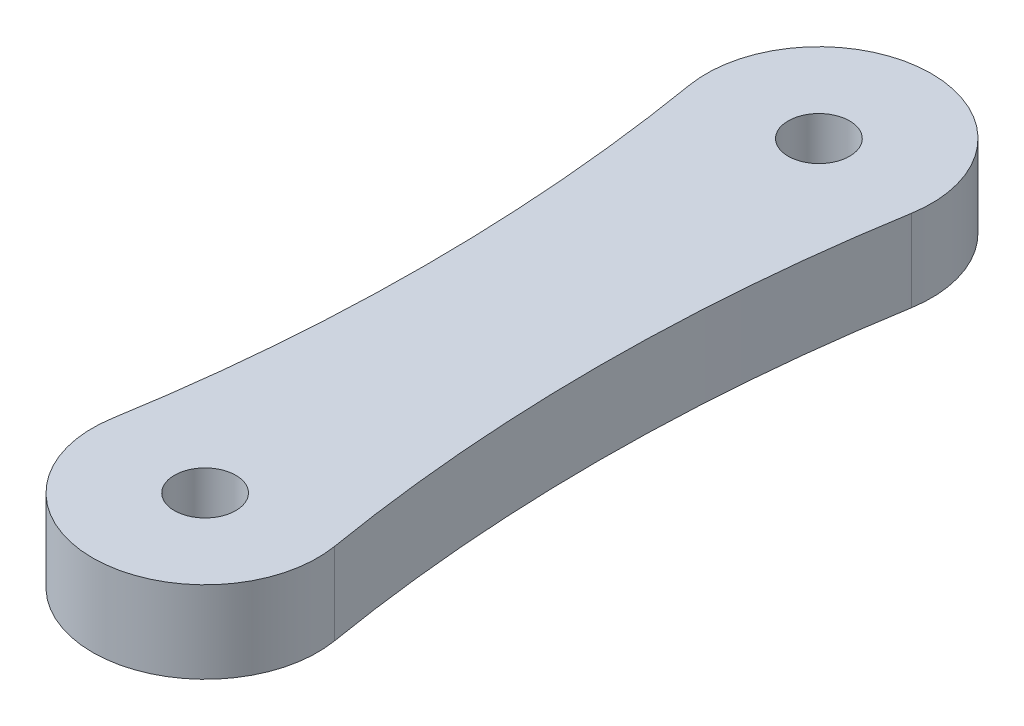
ISO-10303-21;
HEADER;
FILE_DESCRIPTION(('STEP AP214'),'2;1');
FILE_NAME('part.step','',(''),(''),'','','');
FILE_SCHEMA(('AUTOMOTIVE_DESIGN { 1 0 10303 214 1 1 1 1 }'));
ENDSEC;
DATA;
#1=APPLICATION_CONTEXT('core data for automotive mechanical design processes');
#2=APPLICATION_PROTOCOL_DEFINITION('international standard','automotive_design',2000,#1);
#3=PRODUCT_CONTEXT('',#1,'mechanical');
#4=PRODUCT('Part','Part','',(#3));
#5=PRODUCT_RELATED_PRODUCT_CATEGORY('part','',(#4));
#6=PRODUCT_DEFINITION_FORMATION('','',#4);
#7=PRODUCT_DEFINITION_CONTEXT('part definition',#1,'design');
#8=PRODUCT_DEFINITION('design','',#6,#7);
#9=PRODUCT_DEFINITION_SHAPE('','',#8);
#10=(LENGTH_UNIT() NAMED_UNIT(*) SI_UNIT(.MILLI.,.METRE.));
#11=(NAMED_UNIT(*) PLANE_ANGLE_UNIT() SI_UNIT($,.RADIAN.));
#12=(NAMED_UNIT(*) SI_UNIT($,.STERADIAN.) SOLID_ANGLE_UNIT());
#13=UNCERTAINTY_MEASURE_WITH_UNIT(LENGTH_MEASURE(1.E-05),#10,'distance_accuracy_value','');
#14=(GEOMETRIC_REPRESENTATION_CONTEXT(3) GLOBAL_UNCERTAINTY_ASSIGNED_CONTEXT((#13)) GLOBAL_UNIT_ASSIGNED_CONTEXT((#10,
#11,#12)) REPRESENTATION_CONTEXT('',''));
#15=CARTESIAN_POINT('',(0.,0.,0.));
#16=DIRECTION('',(0.,0.,1.));
#17=DIRECTION('',(1.,0.,0.));
#18=AXIS2_PLACEMENT_3D('',#15,#16,#17);
#19=CARTESIAN_POINT('',(-44.6875,4.,-7.49999999999998));
#20=DIRECTION('',(0.,-1.,0.));
#21=DIRECTION('',(0.,0.,-1.));
#22=AXIS2_PLACEMENT_3D('',#19,#20,#21);
#23=PLANE('',#22);
#24=CARTESIAN_POINT('',(-89.375,4.,-15.));
#25=DIRECTION('',(0.,-1.,0.));
#26=DIRECTION('',(0.,0.,-1.));
#27=AXIS2_PLACEMENT_3D('',#24,#25,#26);
#28=CIRCLE('',#27,85.125);
#29=CARTESIAN_POINT('',(-5.42413793103448,4.,-29.0896551724138));
#30=VERTEX_POINT('',#29);
#31=CARTESIAN_POINT('',(-5.42413793103449,4.,-0.910344827586199));
#32=VERTEX_POINT('',#31);
#33=EDGE_CURVE('E85',#30,#32,#28,.T.);
#34=ORIENTED_EDGE('',*,*,#33,.T.);
#35=CARTESIAN_POINT('',(0.,4.,0.));
#36=DIRECTION('',(0.,1.,0.));
#37=DIRECTION('',(0.,0.,1.));
#38=AXIS2_PLACEMENT_3D('',#35,#36,#37);
#39=CIRCLE('',#38,5.5);
#40=CARTESIAN_POINT('',(5.42413793103449,4.,-0.910344827586195));
#41=VERTEX_POINT('',#40);
#42=EDGE_CURVE('E80',#32,#41,#39,.T.);
#43=ORIENTED_EDGE('',*,*,#42,.T.);
#44=CARTESIAN_POINT('',(89.375,4.,-15.));
#45=DIRECTION('',(0.,-1.,0.));
#46=DIRECTION('',(0.,0.,1.));
#47=AXIS2_PLACEMENT_3D('',#44,#45,#46);
#48=CIRCLE('',#47,85.125);
#49=CARTESIAN_POINT('',(5.42413793103447,4.,-29.0896551724138));
#50=VERTEX_POINT('',#49);
#51=EDGE_CURVE('E83',#41,#50,#48,.T.);
#52=ORIENTED_EDGE('',*,*,#51,.T.);
#53=CARTESIAN_POINT('',(0.,4.,-30.));
#54=DIRECTION('',(0.,1.,0.));
#55=DIRECTION('',(0.,0.,1.));
#56=AXIS2_PLACEMENT_3D('',#53,#54,#55);
#57=CIRCLE('',#56,5.49999999999999);
#58=EDGE_CURVE('E50',#50,#30,#57,.T.);
#59=ORIENTED_EDGE('',*,*,#58,.T.);
#60=EDGE_LOOP('',(#34,#43,#52,#59));
#61=FACE_BOUND('',#60,.T.);
#62=CARTESIAN_POINT('',(0.,4.,0.));
#63=DIRECTION('',(0.,1.,0.));
#64=DIRECTION('',(0.,0.,1.));
#65=AXIS2_PLACEMENT_3D('',#62,#63,#64);
#66=CIRCLE('',#65,1.5);
#67=CARTESIAN_POINT('',(0.,4.,1.5));
#68=VERTEX_POINT('',#67);
#69=EDGE_CURVE('E100',#68,#68,#66,.T.);
#70=ORIENTED_EDGE('',*,*,#69,.F.);
#71=EDGE_LOOP('',(#70));
#72=FACE_BOUND('',#71,.T.);
#73=CARTESIAN_POINT('',(0.,4.,-30.));
#74=DIRECTION('',(0.,1.,0.));
#75=DIRECTION('',(0.,0.,1.));
#76=AXIS2_PLACEMENT_3D('',#73,#74,#75);
#77=CIRCLE('',#76,1.5);
#78=CARTESIAN_POINT('',(0.,4.,-28.5));
#79=VERTEX_POINT('',#78);
#80=EDGE_CURVE('E115',#79,#79,#77,.T.);
#81=ORIENTED_EDGE('',*,*,#80,.F.);
#82=EDGE_LOOP('',(#81));
#83=FACE_BOUND('',#82,.T.);
#84=ADVANCED_FACE('F33',(#61,#72,#83),#23,.F.);
#85=CARTESIAN_POINT('',(-44.6875,0.,-7.49999999999998));
#86=DIRECTION('',(0.,-1.,0.));
#87=DIRECTION('',(0.,0.,-1.));
#88=AXIS2_PLACEMENT_3D('',#85,#86,#87);
#89=PLANE('',#88);
#90=CARTESIAN_POINT('',(0.,0.,0.));
#91=DIRECTION('',(0.,1.,0.));
#92=DIRECTION('',(0.,0.,1.));
#93=AXIS2_PLACEMENT_3D('',#90,#91,#92);
#94=CIRCLE('',#93,1.5);
#95=CARTESIAN_POINT('',(0.,0.,1.5));
#96=VERTEX_POINT('',#95);
#97=EDGE_CURVE('E112',#96,#96,#94,.T.);
#98=ORIENTED_EDGE('',*,*,#97,.T.);
#99=EDGE_LOOP('',(#98));
#100=FACE_BOUND('',#99,.T.);
#101=CARTESIAN_POINT('',(-89.375,0.,-15.));
#102=DIRECTION('',(0.,-1.,0.));
#103=DIRECTION('',(0.,0.,-1.));
#104=AXIS2_PLACEMENT_3D('',#101,#102,#103);
#105=CIRCLE('',#104,85.125);
#106=CARTESIAN_POINT('',(-5.42413793103448,0.,-29.0896551724138));
#107=VERTEX_POINT('',#106);
#108=CARTESIAN_POINT('',(-5.42413793103449,0.,-0.910344827586199));
#109=VERTEX_POINT('',#108);
#110=EDGE_CURVE('E97',#107,#109,#105,.T.);
#111=ORIENTED_EDGE('',*,*,#110,.F.);
#112=CARTESIAN_POINT('',(0.,0.,-30.));
#113=DIRECTION('',(0.,1.,0.));
#114=DIRECTION('',(0.,0.,1.));
#115=AXIS2_PLACEMENT_3D('',#112,#113,#114);
#116=CIRCLE('',#115,5.49999999999999);
#117=CARTESIAN_POINT('',(5.42413793103447,0.,-29.0896551724138));
#118=VERTEX_POINT('',#117);
#119=EDGE_CURVE('E73',#118,#107,#116,.T.);
#120=ORIENTED_EDGE('',*,*,#119,.F.);
#121=CARTESIAN_POINT('',(89.375,0.,-15.));
#122=DIRECTION('',(0.,-1.,0.));
#123=DIRECTION('',(0.,0.,1.));
#124=AXIS2_PLACEMENT_3D('',#121,#122,#123);
#125=CIRCLE('',#124,85.125);
#126=CARTESIAN_POINT('',(5.42413793103449,0.,-0.910344827586195));
#127=VERTEX_POINT('',#126);
#128=EDGE_CURVE('E67',#127,#118,#125,.T.);
#129=ORIENTED_EDGE('',*,*,#128,.F.);
#130=CARTESIAN_POINT('',(0.,0.,0.));
#131=DIRECTION('',(0.,1.,0.));
#132=DIRECTION('',(0.,0.,1.));
#133=AXIS2_PLACEMENT_3D('',#130,#131,#132);
#134=CIRCLE('',#133,5.5);
#135=EDGE_CURVE('E89',#109,#127,#134,.T.);
#136=ORIENTED_EDGE('',*,*,#135,.F.);
#137=EDGE_LOOP('',(#111,#120,#129,#136));
#138=FACE_BOUND('',#137,.T.);
#139=CARTESIAN_POINT('',(0.,0.,-30.));
#140=DIRECTION('',(0.,1.,0.));
#141=DIRECTION('',(0.,0.,1.));
#142=AXIS2_PLACEMENT_3D('',#139,#140,#141);
#143=CIRCLE('',#142,1.5);
#144=CARTESIAN_POINT('',(0.,0.,-28.5));
#145=VERTEX_POINT('',#144);
#146=EDGE_CURVE('E118',#145,#145,#143,.T.);
#147=ORIENTED_EDGE('',*,*,#146,.T.);
#148=EDGE_LOOP('',(#147));
#149=FACE_BOUND('',#148,.T.);
#150=ADVANCED_FACE('F108',(#100,#138,#149),#89,.T.);
#151=CARTESIAN_POINT('',(-89.375,4.,-15.));
#152=DIRECTION('',(0.,-1.,0.));
#153=DIRECTION('',(0.,0.,-1.));
#154=AXIS2_PLACEMENT_3D('',#151,#152,#153);
#155=CYLINDRICAL_SURFACE('',#154,85.125);
#156=ORIENTED_EDGE('',*,*,#110,.T.);
#157=DIRECTION('',(0.,-1.,0.));
#158=VECTOR('',#157,1.);
#159=CARTESIAN_POINT('',(-5.42413793103449,4.,-0.910344827586199));
#160=LINE('',#159,#158);
#161=EDGE_CURVE('E11',#32,#109,#160,.T.);
#162=ORIENTED_EDGE('',*,*,#161,.F.);
#163=ORIENTED_EDGE('',*,*,#33,.F.);
#164=DIRECTION('',(0.,-1.,0.));
#165=VECTOR('',#164,1.);
#166=CARTESIAN_POINT('',(-5.42413793103448,4.,-29.0896551724138));
#167=LINE('',#166,#165);
#168=EDGE_CURVE('E93',#30,#107,#167,.T.);
#169=ORIENTED_EDGE('',*,*,#168,.T.);
#170=EDGE_LOOP('',(#156,#162,#163,#169));
#171=FACE_BOUND('',#170,.T.);
#172=ADVANCED_FACE('F35',(#171),#155,.F.);
#173=CARTESIAN_POINT('',(0.,4.,0.));
#174=DIRECTION('',(0.,-1.,0.));
#175=DIRECTION('',(0.,0.,-1.));
#176=AXIS2_PLACEMENT_3D('',#173,#174,#175);
#177=CYLINDRICAL_SURFACE('',#176,5.5);
#178=ORIENTED_EDGE('',*,*,#135,.T.);
#179=DIRECTION('',(0.,-1.,0.));
#180=VECTOR('',#179,1.);
#181=CARTESIAN_POINT('',(5.42413793103449,4.,-0.910344827586195));
#182=LINE('',#181,#180);
#183=EDGE_CURVE('E42',#41,#127,#182,.T.);
#184=ORIENTED_EDGE('',*,*,#183,.F.);
#185=ORIENTED_EDGE('',*,*,#42,.F.);
#186=ORIENTED_EDGE('',*,*,#161,.T.);
#187=EDGE_LOOP('',(#178,#184,#185,#186));
#188=FACE_BOUND('',#187,.T.);
#189=ADVANCED_FACE('F88',(#188),#177,.T.);
#190=CARTESIAN_POINT('',(89.375,4.,-15.));
#191=DIRECTION('',(0.,-1.,0.));
#192=DIRECTION('',(0.,0.,-1.));
#193=AXIS2_PLACEMENT_3D('',#190,#191,#192);
#194=CYLINDRICAL_SURFACE('',#193,85.125);
#195=ORIENTED_EDGE('',*,*,#128,.T.);
#196=DIRECTION('',(0.,-1.,0.));
#197=VECTOR('',#196,1.);
#198=CARTESIAN_POINT('',(5.42413793103447,4.,-29.0896551724138));
#199=LINE('',#198,#197);
#200=EDGE_CURVE('E90',#50,#118,#199,.T.);
#201=ORIENTED_EDGE('',*,*,#200,.F.);
#202=ORIENTED_EDGE('',*,*,#51,.F.);
#203=ORIENTED_EDGE('',*,*,#183,.T.);
#204=EDGE_LOOP('',(#195,#201,#202,#203));
#205=FACE_BOUND('',#204,.T.);
#206=ADVANCED_FACE('F91',(#205),#194,.F.);
#207=CARTESIAN_POINT('',(0.,4.,-30.));
#208=DIRECTION('',(0.,-1.,0.));
#209=DIRECTION('',(0.,0.,-1.));
#210=AXIS2_PLACEMENT_3D('',#207,#208,#209);
#211=CYLINDRICAL_SURFACE('',#210,5.49999999999999);
#212=ORIENTED_EDGE('',*,*,#119,.T.);
#213=ORIENTED_EDGE('',*,*,#168,.F.);
#214=ORIENTED_EDGE('',*,*,#58,.F.);
#215=ORIENTED_EDGE('',*,*,#200,.T.);
#216=EDGE_LOOP('',(#212,#213,#214,#215));
#217=FACE_BOUND('',#216,.T.);
#218=ADVANCED_FACE('F105',(#217),#211,.T.);
#219=CARTESIAN_POINT('',(0.,4.,0.));
#220=DIRECTION('',(0.,-1.,0.));
#221=DIRECTION('',(0.,0.,-1.));
#222=AXIS2_PLACEMENT_3D('',#219,#220,#221);
#223=CYLINDRICAL_SURFACE('',#222,1.5);
#224=ORIENTED_EDGE('',*,*,#69,.T.);
#225=EDGE_LOOP('',(#224));
#226=FACE_BOUND('',#225,.T.);
#227=ORIENTED_EDGE('',*,*,#97,.F.);
#228=EDGE_LOOP('',(#227));
#229=FACE_BOUND('',#228,.T.);
#230=ADVANCED_FACE('F135',(#226,#229),#223,.F.);
#231=CARTESIAN_POINT('',(0.,4.,-30.));
#232=DIRECTION('',(0.,-1.,0.));
#233=DIRECTION('',(0.,0.,-1.));
#234=AXIS2_PLACEMENT_3D('',#231,#232,#233);
#235=CYLINDRICAL_SURFACE('',#234,1.5);
#236=ORIENTED_EDGE('',*,*,#80,.T.);
#237=EDGE_LOOP('',(#236));
#238=FACE_BOUND('',#237,.T.);
#239=ORIENTED_EDGE('',*,*,#146,.F.);
#240=EDGE_LOOP('',(#239));
#241=FACE_BOUND('',#240,.T.);
#242=ADVANCED_FACE('F124',(#238,#241),#235,.F.);
#243=CLOSED_SHELL('',(#84,#150,#172,#189,#206,#218,#230,#242));
#244=MANIFOLD_SOLID_BREP('B2',#243);
#245=ADVANCED_BREP_SHAPE_REPRESENTATION('',(#18,#244),#14);
#246=SHAPE_DEFINITION_REPRESENTATION(#9,#245);
ENDSEC;
END-ISO-10303-21;
